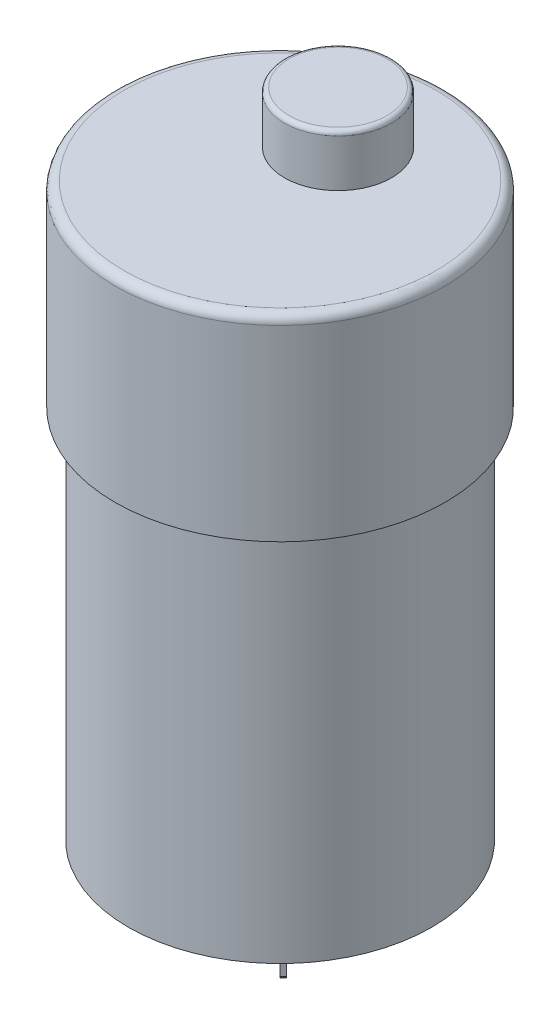
ISO-10303-21;
HEADER;
FILE_DESCRIPTION(('STEP AP214'),'2;1');
FILE_NAME('part.step','',(''),(''),'','','');
FILE_SCHEMA(('AUTOMOTIVE_DESIGN { 1 0 10303 214 1 1 1 1 }'));
ENDSEC;
DATA;
#1=APPLICATION_CONTEXT('core data for automotive mechanical design processes');
#2=APPLICATION_PROTOCOL_DEFINITION('international standard','automotive_design',2000,#1);
#3=PRODUCT_CONTEXT('',#1,'mechanical');
#4=PRODUCT('Part','Part','',(#3));
#5=PRODUCT_RELATED_PRODUCT_CATEGORY('part','',(#4));
#6=PRODUCT_DEFINITION_FORMATION('','',#4);
#7=PRODUCT_DEFINITION_CONTEXT('part definition',#1,'design');
#8=PRODUCT_DEFINITION('design','',#6,#7);
#9=PRODUCT_DEFINITION_SHAPE('','',#8);
#10=(LENGTH_UNIT() NAMED_UNIT(*) SI_UNIT(.MILLI.,.METRE.));
#11=(NAMED_UNIT(*) PLANE_ANGLE_UNIT() SI_UNIT($,.RADIAN.));
#12=(NAMED_UNIT(*) SI_UNIT($,.STERADIAN.) SOLID_ANGLE_UNIT());
#13=UNCERTAINTY_MEASURE_WITH_UNIT(LENGTH_MEASURE(1.E-05),#10,'distance_accuracy_value','');
#14=(GEOMETRIC_REPRESENTATION_CONTEXT(3) GLOBAL_UNCERTAINTY_ASSIGNED_CONTEXT((#13)) GLOBAL_UNIT_ASSIGNED_CONTEXT((#10,
#11,#12)) REPRESENTATION_CONTEXT('',''));
#15=CARTESIAN_POINT('',(0.,0.,0.));
#16=DIRECTION('',(0.,0.,1.));
#17=DIRECTION('',(1.,0.,0.));
#18=AXIS2_PLACEMENT_3D('',#15,#16,#17);
#19=CARTESIAN_POINT('',(0.,-44.5,0.));
#20=DIRECTION('',(0.,-1.,0.));
#21=DIRECTION('',(0.,0.,-1.));
#22=AXIS2_PLACEMENT_3D('',#19,#20,#21);
#23=PLANE('',#22);
#24=CARTESIAN_POINT('',(0.,-44.4999999999709,0.));
#25=DIRECTION('',(0.,1.,0.));
#26=DIRECTION('',(0.,0.,1.));
#27=AXIS2_PLACEMENT_3D('',#24,#25,#26);
#28=CIRCLE('',#27,1.99999999995271);
#29=CARTESIAN_POINT('',(0.,-44.4999999999709,1.99999999995271));
#30=VERTEX_POINT('',#29);
#31=EDGE_CURVE('E18',#30,#30,#28,.T.);
#32=ORIENTED_EDGE('',*,*,#31,.F.);
#33=EDGE_LOOP('',(#32));
#34=FACE_BOUND('',#33,.T.);
#35=ADVANCED_FACE('F15',(#34),#23,.T.);
#36=CARTESIAN_POINT('',(0.,27.8,0.));
#37=DIRECTION('',(0.,1.,0.));
#38=DIRECTION('',(0.,0.,1.));
#39=AXIS2_PLACEMENT_3D('',#36,#37,#38);
#40=PLANE('',#39);
#41=CARTESIAN_POINT('',(0.,27.8,-6.5));
#42=DIRECTION('',(0.,-1.,0.));
#43=DIRECTION('',(1.,0.,0.));
#44=AXIS2_PLACEMENT_3D('',#41,#42,#43);
#45=CIRCLE('',#44,5.5);
#46=CARTESIAN_POINT('',(5.5,27.8,-6.5));
#47=VERTEX_POINT('',#46);
#48=EDGE_CURVE('E229',#47,#47,#45,.T.);
#49=ORIENTED_EDGE('',*,*,#48,.F.);
#50=EDGE_LOOP('',(#49));
#51=FACE_BOUND('',#50,.T.);
#52=ADVANCED_FACE('F233',(#51),#40,.T.);
#53=CARTESIAN_POINT('',(0.,-43.4999999999945,0.));
#54=DIRECTION('',(0.,1.,0.));
#55=DIRECTION('',(0.,0.,1.));
#56=AXIS2_PLACEMENT_3D('',#53,#54,#55);
#57=CONICAL_SURFACE('',#56,2.9999999999859,0.78539816342587);
#58=CARTESIAN_POINT('',(0.,-43.5,0.));
#59=DIRECTION('',(0.,-1.,0.));
#60=DIRECTION('',(0.,0.,-1.));
#61=AXIS2_PLACEMENT_3D('',#58,#59,#60);
#62=CIRCLE('',#61,3.);
#63=CARTESIAN_POINT('',(0.,-43.5,-3.));
#64=VERTEX_POINT('',#63);
#65=EDGE_CURVE('E351',#64,#64,#62,.F.);
#66=ORIENTED_EDGE('',*,*,#65,.F.);
#67=EDGE_LOOP('',(#66));
#68=FACE_BOUND('',#67,.T.);
#69=ORIENTED_EDGE('',*,*,#31,.T.);
#70=EDGE_LOOP('',(#69));
#71=FACE_BOUND('',#70,.T.);
#72=ADVANCED_FACE('F217',(#68,#71),#57,.T.);
#73=CARTESIAN_POINT('',(0.,27.3,-6.5));
#74=DIRECTION('',(0.,1.,0.));
#75=DIRECTION('',(0.,0.,1.));
#76=AXIS2_PLACEMENT_3D('',#73,#74,#75);
#77=TOROIDAL_SURFACE('',#76,5.5,0.5);
#78=CARTESIAN_POINT('',(0.,27.3,-6.5));
#79=DIRECTION('',(0.,1.,0.));
#80=DIRECTION('',(0.,0.,1.));
#81=AXIS2_PLACEMENT_3D('',#78,#79,#80);
#82=CIRCLE('',#81,6.);
#83=CARTESIAN_POINT('',(0.,27.3,-0.5));
#84=VERTEX_POINT('',#83);
#85=EDGE_CURVE('E348',#84,#84,#82,.F.);
#86=ORIENTED_EDGE('',*,*,#85,.F.);
#87=EDGE_LOOP('',(#86));
#88=FACE_BOUND('',#87,.T.);
#89=ORIENTED_EDGE('',*,*,#48,.T.);
#90=EDGE_LOOP('',(#89));
#91=FACE_BOUND('',#90,.T.);
#92=ADVANCED_FACE('F211',(#88,#91),#77,.T.);
#93=CARTESIAN_POINT('',(0.,-41.,0.));
#94=DIRECTION('',(0.,-1.,0.));
#95=DIRECTION('',(0.,0.,-1.));
#96=AXIS2_PLACEMENT_3D('',#93,#94,#95);
#97=CYLINDRICAL_SURFACE('',#96,3.);
#98=CARTESIAN_POINT('',(0.,-42.,0.));
#99=DIRECTION('',(0.,-1.,0.));
#100=DIRECTION('',(0.,0.,-1.));
#101=AXIS2_PLACEMENT_3D('',#98,#99,#100);
#102=CIRCLE('',#101,3.);
#103=CARTESIAN_POINT('',(0.,-42.,-3.));
#104=VERTEX_POINT('',#103);
#105=EDGE_CURVE('E131',#104,#104,#102,.T.);
#106=ORIENTED_EDGE('',*,*,#105,.T.);
#107=EDGE_LOOP('',(#106));
#108=FACE_BOUND('',#107,.T.);
#109=ORIENTED_EDGE('',*,*,#65,.T.);
#110=EDGE_LOOP('',(#109));
#111=FACE_BOUND('',#110,.T.);
#112=ADVANCED_FACE('F207',(#108,#111),#97,.T.);
#113=CARTESIAN_POINT('',(0.,22.,-6.5));
#114=DIRECTION('',(0.,1.,0.));
#115=DIRECTION('',(0.,0.,1.));
#116=AXIS2_PLACEMENT_3D('',#113,#114,#115);
#117=CYLINDRICAL_SURFACE('',#116,6.);
#118=CARTESIAN_POINT('',(0.,22.,-6.5));
#119=DIRECTION('',(0.,1.,0.));
#120=DIRECTION('',(0.,0.,1.));
#121=AXIS2_PLACEMENT_3D('',#118,#119,#120);
#122=CIRCLE('',#121,6.);
#123=CARTESIAN_POINT('',(0.,22.,-0.5));
#124=VERTEX_POINT('',#123);
#125=EDGE_CURVE('E128',#124,#124,#122,.F.);
#126=ORIENTED_EDGE('',*,*,#125,.F.);
#127=EDGE_LOOP('',(#126));
#128=FACE_BOUND('',#127,.T.);
#129=ORIENTED_EDGE('',*,*,#85,.T.);
#130=EDGE_LOOP('',(#129));
#131=FACE_BOUND('',#130,.T.);
#132=ADVANCED_FACE('F204',(#128,#131),#117,.T.);
#133=CARTESIAN_POINT('',(9.41866232540484,-45.75,-9.77221571599806));
#134=DIRECTION('',(0.499999999999998,-0.70710678118655,-0.499999999999998));
#135=DIRECTION('',(0.,0.577350269189623,-0.816496580927728));
#136=AXIS2_PLACEMENT_3D('',#133,#134,#135);
#137=PLANE('',#136);
#138=DIRECTION('',(-0.500000000000015,-0.707106781186526,0.500000000000015));
#139=VECTOR('',#138,1.);
#140=CARTESIAN_POINT('',(9.41866232540483,-45.5,-10.1257691065914));
#141=LINE('',#140,#139);
#142=CARTESIAN_POINT('',(9.41866232540481,-45.5,-10.1257691065914));
#143=VERTEX_POINT('',#142);
#144=CARTESIAN_POINT('',(9.06510893481154,-46.,-9.77221571599808));
#145=VERTEX_POINT('',#144);
#146=EDGE_CURVE('E108',#143,#145,#141,.T.);
#147=ORIENTED_EDGE('',*,*,#146,.F.);
#148=DIRECTION('',(-0.707106781186548,0.,-0.707106781186548));
#149=VECTOR('',#148,1.);
#150=CARTESIAN_POINT('',(9.41866232540481,-45.5,-10.1257691065914));
#151=LINE('',#150,#149);
#152=CARTESIAN_POINT('',(9.77221571599809,-45.5,-9.77221571599809));
#153=VERTEX_POINT('',#152);
#154=EDGE_CURVE('E104',#153,#143,#151,.T.);
#155=ORIENTED_EDGE('',*,*,#154,.F.);
#156=DIRECTION('',(0.500000000000004,0.707106781186542,-0.500000000000004));
#157=VECTOR('',#156,1.);
#158=CARTESIAN_POINT('',(9.41866232540481,-46.,-9.41866232540481));
#159=LINE('',#158,#157);
#160=CARTESIAN_POINT('',(9.41866232540481,-46.,-9.41866232540481));
#161=VERTEX_POINT('',#160);
#162=EDGE_CURVE('E101',#161,#153,#159,.T.);
#163=ORIENTED_EDGE('',*,*,#162,.F.);
#164=DIRECTION('',(0.707106781186548,0.,0.707106781186548));
#165=VECTOR('',#164,1.);
#166=CARTESIAN_POINT('',(9.06510893481154,-46.,-9.77221571599808));
#167=LINE('',#166,#165);
#168=EDGE_CURVE('E346',#145,#161,#167,.T.);
#169=ORIENTED_EDGE('',*,*,#168,.F.);
#170=EDGE_LOOP('',(#147,#155,#163,#169));
#171=FACE_BOUND('',#170,.T.);
#172=ADVANCED_FACE('F106',(#171),#137,.T.);
#173=CARTESIAN_POINT('',(0.,-46.,0.));
#174=DIRECTION('',(0.,-1.,0.));
#175=DIRECTION('',(0.,0.,-1.));
#176=AXIS2_PLACEMENT_3D('',#173,#174,#175);
#177=PLANE('',#176);
#178=DIRECTION('',(0.707106781186547,0.,0.707106781186547));
#179=VECTOR('',#178,1.);
#180=CARTESIAN_POINT('',(8.00444876303172,-46.,-8.71155554421827));
#181=LINE('',#180,#179);
#182=CARTESIAN_POINT('',(8.00444876303172,-46.,-8.71155554421827));
#183=VERTEX_POINT('',#182);
#184=CARTESIAN_POINT('',(8.35800215362499,-46.,-8.358002153625));
#185=VERTEX_POINT('',#184);
#186=EDGE_CURVE('E343',#183,#185,#181,.T.);
#187=ORIENTED_EDGE('',*,*,#186,.F.);
#188=DIRECTION('',(-0.707106781186548,0.,0.707106781186547));
#189=VECTOR('',#188,1.);
#190=CARTESIAN_POINT('',(7.65089537243844,-46.,-8.35800215362499));
#191=LINE('',#190,#189);
#192=EDGE_CURVE('E330',#145,#183,#191,.T.);
#193=ORIENTED_EDGE('',*,*,#192,.F.);
#194=ORIENTED_EDGE('',*,*,#168,.T.);
#195=DIRECTION('',(0.707106781186548,0.,-0.707106781186548));
#196=VECTOR('',#195,1.);
#197=CARTESIAN_POINT('',(9.77221571599809,-46.,-9.77221571599809));
#198=LINE('',#197,#196);
#199=EDGE_CURVE('E127',#185,#161,#198,.T.);
#200=ORIENTED_EDGE('',*,*,#199,.F.);
#201=EDGE_LOOP('',(#187,#193,#194,#200));
#202=FACE_BOUND('',#201,.T.);
#203=ADVANCED_FACE('F197',(#202),#177,.T.);
#204=CARTESIAN_POINT('',(8.00444876303172,-45.75,-8.35800215362499));
#205=DIRECTION('',(-0.499999999999997,-0.70710678118655,0.499999999999999));
#206=DIRECTION('',(0.,-0.577350269189624,-0.816496580927727));
#207=AXIS2_PLACEMENT_3D('',#204,#205,#206);
#208=PLANE('',#207);
#209=DIRECTION('',(0.5,-0.707106781186547,-0.5));
#210=VECTOR('',#209,1.);
#211=CARTESIAN_POINT('',(8.00444876303172,-45.5,-8.00444876303172));
#212=LINE('',#211,#210);
#213=CARTESIAN_POINT('',(8.00444876303172,-45.5,-8.00444876303172));
#214=VERTEX_POINT('',#213);
#215=EDGE_CURVE('E336',#214,#185,#212,.T.);
#216=ORIENTED_EDGE('',*,*,#215,.F.);
#217=DIRECTION('',(0.707106781186548,0.,0.707106781186547));
#218=VECTOR('',#217,1.);
#219=CARTESIAN_POINT('',(8.00444876303172,-45.5,-8.00444876303172));
#220=LINE('',#219,#218);
#221=CARTESIAN_POINT('',(7.65089537243844,-45.5,-8.35800215362499));
#222=VERTEX_POINT('',#221);
#223=EDGE_CURVE('E341',#222,#214,#220,.T.);
#224=ORIENTED_EDGE('',*,*,#223,.F.);
#225=DIRECTION('',(-0.500000000000004,0.707106781186543,0.500000000000002));
#226=VECTOR('',#225,1.);
#227=CARTESIAN_POINT('',(8.00444876303172,-46.,-8.71155554421827));
#228=LINE('',#227,#226);
#229=EDGE_CURVE('E327',#183,#222,#228,.T.);
#230=ORIENTED_EDGE('',*,*,#229,.F.);
#231=ORIENTED_EDGE('',*,*,#186,.T.);
#232=EDGE_LOOP('',(#216,#224,#230,#231));
#233=FACE_BOUND('',#232,.T.);
#234=ADVANCED_FACE('F193',(#233),#208,.T.);
#235=CARTESIAN_POINT('',(8.00444876303172,-41.,-8.00444876303172));
#236=DIRECTION('',(-0.707106781186547,0.,0.707106781186548));
#237=DIRECTION('',(0.707106781186548,0.,0.707106781186547));
#238=AXIS2_PLACEMENT_3D('',#235,#236,#237);
#239=PLANE('',#238);
#240=DIRECTION('',(0.707106781186548,0.,0.707106781186547));
#241=VECTOR('',#240,1.);
#242=CARTESIAN_POINT('',(8.00444876303172,-41.,-8.00444876303172));
#243=LINE('',#242,#241);
#244=CARTESIAN_POINT('',(8.00444876303172,-41.,-8.00444876303172));
#245=VERTEX_POINT('',#244);
#246=CARTESIAN_POINT('',(7.65089537243844,-41.,-8.35800215362499));
#247=VERTEX_POINT('',#246);
#248=EDGE_CURVE('E113',#245,#247,#243,.F.);
#249=ORIENTED_EDGE('',*,*,#248,.T.);
#250=DIRECTION('',(0.,1.,0.));
#251=VECTOR('',#250,1.);
#252=CARTESIAN_POINT('',(7.65089537243844,-41.,-8.35800215362499));
#253=LINE('',#252,#251);
#254=EDGE_CURVE('E324',#222,#247,#253,.T.);
#255=ORIENTED_EDGE('',*,*,#254,.F.);
#256=ORIENTED_EDGE('',*,*,#223,.T.);
#257=DIRECTION('',(0.,1.,0.));
#258=VECTOR('',#257,1.);
#259=CARTESIAN_POINT('',(8.00444876303172,-41.,-8.00444876303172));
#260=LINE('',#259,#258);
#261=EDGE_CURVE('E121',#245,#214,#260,.F.);
#262=ORIENTED_EDGE('',*,*,#261,.F.);
#263=EDGE_LOOP('',(#249,#255,#256,#262));
#264=FACE_BOUND('',#263,.T.);
#265=ADVANCED_FACE('F190',(#264),#239,.T.);
#266=CARTESIAN_POINT('',(9.41866232540481,-41.,-10.1257691065914));
#267=DIRECTION('',(0.707106781186548,0.,-0.707106781186548));
#268=DIRECTION('',(-0.707106781186548,0.,-0.707106781186548));
#269=AXIS2_PLACEMENT_3D('',#266,#267,#268);
#270=PLANE('',#269);
#271=DIRECTION('',(-0.707106781186548,0.,-0.707106781186548));
#272=VECTOR('',#271,1.);
#273=CARTESIAN_POINT('',(9.41866232540481,-41.,-10.1257691065914));
#274=LINE('',#273,#272);
#275=CARTESIAN_POINT('',(9.41866232540482,-41.,-10.1257691065914));
#276=VERTEX_POINT('',#275);
#277=CARTESIAN_POINT('',(9.7722157159981,-41.,-9.7722157159981));
#278=VERTEX_POINT('',#277);
#279=EDGE_CURVE('E112',#276,#278,#274,.F.);
#280=ORIENTED_EDGE('',*,*,#279,.T.);
#281=DIRECTION('',(0.,1.,0.));
#282=VECTOR('',#281,1.);
#283=CARTESIAN_POINT('',(9.77221571599809,-41.,-9.77221571599809));
#284=LINE('',#283,#282);
#285=EDGE_CURVE('E116',#153,#278,#284,.T.);
#286=ORIENTED_EDGE('',*,*,#285,.F.);
#287=ORIENTED_EDGE('',*,*,#154,.T.);
#288=DIRECTION('',(0.,1.,0.));
#289=VECTOR('',#288,1.);
#290=CARTESIAN_POINT('',(9.41866232540483,-41.,-10.1257691065914));
#291=LINE('',#290,#289);
#292=EDGE_CURVE('E322',#276,#143,#291,.F.);
#293=ORIENTED_EDGE('',*,*,#292,.F.);
#294=EDGE_LOOP('',(#280,#286,#287,#293));
#295=FACE_BOUND('',#294,.T.);
#296=ADVANCED_FACE('F117',(#295),#270,.T.);
#297=CARTESIAN_POINT('',(8.53477884892163,-45.,-9.24188563010818));
#298=DIRECTION('',(-0.707106781186547,0.,-0.707106781186548));
#299=DIRECTION('',(-0.707106781186548,0.,0.707106781186547));
#300=AXIS2_PLACEMENT_3D('',#297,#298,#299);
#301=CYLINDRICAL_SURFACE('',#300,0.5);
#302=CARTESIAN_POINT('',(8.53477884892163,-45.,-9.24188563010818));
#303=DIRECTION('',(-0.707106781186547,0.,-0.707106781186548));
#304=DIRECTION('',(-0.707106781186548,0.,0.707106781186547));
#305=AXIS2_PLACEMENT_3D('',#302,#303,#304);
#306=CIRCLE('',#305,0.5);
#307=CARTESIAN_POINT('',(8.18122545832836,-45.,-8.88833223951491));
#308=VERTEX_POINT('',#307);
#309=EDGE_CURVE('E321',#308,#308,#306,.F.);
#310=ORIENTED_EDGE('',*,*,#309,.F.);
#311=EDGE_LOOP('',(#310));
#312=FACE_BOUND('',#311,.T.);
#313=CARTESIAN_POINT('',(8.88833223951491,-45.,-8.88833223951491));
#314=DIRECTION('',(-0.707106781186547,0.,-0.707106781186548));
#315=DIRECTION('',(-0.707106781186548,0.,0.707106781186547));
#316=AXIS2_PLACEMENT_3D('',#313,#314,#315);
#317=CIRCLE('',#316,0.5);
#318=CARTESIAN_POINT('',(8.53477884892163,-45.,-8.53477884892163));
#319=VERTEX_POINT('',#318);
#320=EDGE_CURVE('E334',#319,#319,#317,.T.);
#321=ORIENTED_EDGE('',*,*,#320,.F.);
#322=EDGE_LOOP('',(#321));
#323=FACE_BOUND('',#322,.T.);
#324=ADVANCED_FACE('F183',(#312,#323),#301,.F.);
#325=CARTESIAN_POINT('',(8.358002153625,-45.75,8.00444876303171));
#326=DIRECTION('',(-0.5,-0.707106781186547,-0.5));
#327=DIRECTION('',(0.,0.577350269189626,-0.816496580927726));
#328=AXIS2_PLACEMENT_3D('',#325,#326,#327);
#329=PLANE('',#328);
#330=DIRECTION('',(0.499999999999998,-0.707106781186552,0.499999999999996));
#331=VECTOR('',#330,1.);
#332=CARTESIAN_POINT('',(8.00444876303172,-45.5,8.00444876303172));
#333=LINE('',#332,#331);
#334=CARTESIAN_POINT('',(8.00444876303172,-45.5,8.00444876303172));
#335=VERTEX_POINT('',#334);
#336=CARTESIAN_POINT('',(8.35800215362499,-46.,8.35800215362499));
#337=VERTEX_POINT('',#336);
#338=EDGE_CURVE('E318',#335,#337,#333,.T.);
#339=ORIENTED_EDGE('',*,*,#338,.F.);
#340=DIRECTION('',(-0.707106781186547,0.,0.707106781186548));
#341=VECTOR('',#340,1.);
#342=CARTESIAN_POINT('',(8.00444876303172,-45.5,8.00444876303172));
#343=LINE('',#342,#341);
#344=CARTESIAN_POINT('',(8.35800215362499,-45.5,7.65089537243844));
#345=VERTEX_POINT('',#344);
#346=EDGE_CURVE('E365',#345,#335,#343,.T.);
#347=ORIENTED_EDGE('',*,*,#346,.F.);
#348=DIRECTION('',(-0.500000000000004,0.707106781186543,-0.500000000000002));
#349=VECTOR('',#348,1.);
#350=CARTESIAN_POINT('',(8.71155554421827,-46.,8.00444876303172));
#351=LINE('',#350,#349);
#352=CARTESIAN_POINT('',(8.71155554421827,-46.,8.00444876303172));
#353=VERTEX_POINT('',#352);
#354=EDGE_CURVE('E302',#353,#345,#351,.T.);
#355=ORIENTED_EDGE('',*,*,#354,.F.);
#356=DIRECTION('',(0.707106781186554,0.,-0.707106781186541));
#357=VECTOR('',#356,1.);
#358=CARTESIAN_POINT('',(8.35800215362499,-46.,8.35800215362499));
#359=LINE('',#358,#357);
#360=EDGE_CURVE('E373',#337,#353,#359,.T.);
#361=ORIENTED_EDGE('',*,*,#360,.F.);
#362=EDGE_LOOP('',(#339,#347,#355,#361));
#363=FACE_BOUND('',#362,.T.);
#364=ADVANCED_FACE('F180',(#363),#329,.T.);
#365=CARTESIAN_POINT('',(8.00444876303172,-41.,8.00444876303172));
#366=DIRECTION('',(-0.707106781186548,0.,-0.707106781186547));
#367=DIRECTION('',(-0.707106781186547,0.,0.707106781186548));
#368=AXIS2_PLACEMENT_3D('',#365,#366,#367);
#369=PLANE('',#368);
#370=DIRECTION('',(-0.707106781186547,0.,0.707106781186548));
#371=VECTOR('',#370,1.);
#372=CARTESIAN_POINT('',(8.00444876303172,-41.,8.00444876303172));
#373=LINE('',#372,#371);
#374=CARTESIAN_POINT('',(8.00444876303172,-41.,8.00444876303172));
#375=VERTEX_POINT('',#374);
#376=CARTESIAN_POINT('',(8.35800215362499,-41.,7.65089537243845));
#377=VERTEX_POINT('',#376);
#378=EDGE_CURVE('E33',#375,#377,#373,.F.);
#379=ORIENTED_EDGE('',*,*,#378,.T.);
#380=DIRECTION('',(0.,1.,0.));
#381=VECTOR('',#380,1.);
#382=CARTESIAN_POINT('',(8.35800215362499,-41.,7.65089537243844));
#383=LINE('',#382,#381);
#384=EDGE_CURVE('E300',#345,#377,#383,.T.);
#385=ORIENTED_EDGE('',*,*,#384,.F.);
#386=ORIENTED_EDGE('',*,*,#346,.T.);
#387=DIRECTION('',(0.,1.,0.));
#388=VECTOR('',#387,1.);
#389=CARTESIAN_POINT('',(8.00444876303172,-41.,8.00444876303172));
#390=LINE('',#389,#388);
#391=EDGE_CURVE('E306',#375,#335,#390,.F.);
#392=ORIENTED_EDGE('',*,*,#391,.F.);
#393=EDGE_LOOP('',(#379,#385,#386,#392));
#394=FACE_BOUND('',#393,.T.);
#395=ADVANCED_FACE('F176',(#394),#369,.T.);
#396=CARTESIAN_POINT('',(10.1257691065914,-41.,9.41866232540482));
#397=DIRECTION('',(0.707106781186548,0.,0.707106781186547));
#398=DIRECTION('',(0.707106781186547,0.,-0.707106781186548));
#399=AXIS2_PLACEMENT_3D('',#396,#397,#398);
#400=PLANE('',#399);
#401=DIRECTION('',(0.707106781186547,0.,-0.707106781186548));
#402=VECTOR('',#401,1.);
#403=CARTESIAN_POINT('',(10.1257691065914,-41.,9.41866232540482));
#404=LINE('',#403,#402);
#405=CARTESIAN_POINT('',(10.1257691065914,-41.,9.41866232540482));
#406=VERTEX_POINT('',#405);
#407=CARTESIAN_POINT('',(9.7722157159981,-41.,9.7722157159981));
#408=VERTEX_POINT('',#407);
#409=EDGE_CURVE('E369',#406,#408,#404,.F.);
#410=ORIENTED_EDGE('',*,*,#409,.T.);
#411=DIRECTION('',(0.,1.,0.));
#412=VECTOR('',#411,1.);
#413=CARTESIAN_POINT('',(9.77221571599809,-41.,9.77221571599809));
#414=LINE('',#413,#412);
#415=CARTESIAN_POINT('',(9.7722157159981,-45.5,9.7722157159981));
#416=VERTEX_POINT('',#415);
#417=EDGE_CURVE('E309',#416,#408,#414,.T.);
#418=ORIENTED_EDGE('',*,*,#417,.F.);
#419=DIRECTION('',(-0.70710678118657,0.,0.707106781186525));
#420=VECTOR('',#419,1.);
#421=CARTESIAN_POINT('',(10.1257691065914,-45.5,9.41866232540481));
#422=LINE('',#421,#420);
#423=CARTESIAN_POINT('',(10.1257691065914,-45.5,9.41866232540482));
#424=VERTEX_POINT('',#423);
#425=EDGE_CURVE('E371',#424,#416,#422,.T.);
#426=ORIENTED_EDGE('',*,*,#425,.F.);
#427=DIRECTION('',(0.,1.,0.));
#428=VECTOR('',#427,1.);
#429=CARTESIAN_POINT('',(10.1257691065914,-41.,9.41866232540483));
#430=LINE('',#429,#428);
#431=EDGE_CURVE('E297',#406,#424,#430,.F.);
#432=ORIENTED_EDGE('',*,*,#431,.F.);
#433=EDGE_LOOP('',(#410,#418,#426,#432));
#434=FACE_BOUND('',#433,.T.);
#435=ADVANCED_FACE('F172',(#434),#400,.T.);
#436=CARTESIAN_POINT('',(9.7722157159981,-45.75,9.41866232540481));
#437=DIRECTION('',(0.499999999999993,-0.707106781186558,0.499999999999993));
#438=DIRECTION('',(0.,-0.577350269189615,-0.816496580927734));
#439=AXIS2_PLACEMENT_3D('',#436,#437,#438);
#440=PLANE('',#439);
#441=DIRECTION('',(-0.500000000000022,-0.707106781186516,-0.500000000000022));
#442=VECTOR('',#441,1.);
#443=CARTESIAN_POINT('',(10.1257691065914,-45.5,9.41866232540483));
#444=LINE('',#443,#442);
#445=CARTESIAN_POINT('',(9.77221571599808,-46.,9.06510893481153));
#446=VERTEX_POINT('',#445);
#447=EDGE_CURVE('E294',#424,#446,#444,.T.);
#448=ORIENTED_EDGE('',*,*,#447,.F.);
#449=ORIENTED_EDGE('',*,*,#425,.T.);
#450=DIRECTION('',(0.499999999999996,0.707106781186552,0.499999999999996));
#451=VECTOR('',#450,1.);
#452=CARTESIAN_POINT('',(9.41866232540482,-46.,9.41866232540482));
#453=LINE('',#452,#451);
#454=CARTESIAN_POINT('',(9.41866232540482,-46.,9.41866232540482));
#455=VERTEX_POINT('',#454);
#456=EDGE_CURVE('E312',#455,#416,#453,.T.);
#457=ORIENTED_EDGE('',*,*,#456,.F.);
#458=DIRECTION('',(-0.707106781186516,0.,0.707106781186579));
#459=VECTOR('',#458,1.);
#460=CARTESIAN_POINT('',(9.77221571599808,-46.,9.06510893481153));
#461=LINE('',#460,#459);
#462=EDGE_CURVE('E376',#446,#455,#461,.T.);
#463=ORIENTED_EDGE('',*,*,#462,.F.);
#464=EDGE_LOOP('',(#448,#449,#457,#463));
#465=FACE_BOUND('',#464,.T.);
#466=ADVANCED_FACE('F168',(#465),#440,.T.);
#467=CARTESIAN_POINT('',(0.,-46.,0.));
#468=DIRECTION('',(0.,-1.,0.));
#469=DIRECTION('',(0.,0.,-1.));
#470=AXIS2_PLACEMENT_3D('',#467,#468,#469);
#471=PLANE('',#470);
#472=ORIENTED_EDGE('',*,*,#462,.T.);
#473=DIRECTION('',(0.707106781186548,0.,0.707106781186547));
#474=VECTOR('',#473,1.);
#475=CARTESIAN_POINT('',(9.77221571599809,-46.,9.77221571599809));
#476=LINE('',#475,#474);
#477=EDGE_CURVE('E315',#337,#455,#476,.T.);
#478=ORIENTED_EDGE('',*,*,#477,.F.);
#479=ORIENTED_EDGE('',*,*,#360,.T.);
#480=DIRECTION('',(-0.707106781186548,0.,-0.707106781186547));
#481=VECTOR('',#480,1.);
#482=CARTESIAN_POINT('',(8.35800215362499,-46.,7.65089537243844));
#483=LINE('',#482,#481);
#484=EDGE_CURVE('E290',#446,#353,#483,.T.);
#485=ORIENTED_EDGE('',*,*,#484,.F.);
#486=EDGE_LOOP('',(#472,#478,#479,#485));
#487=FACE_BOUND('',#486,.T.);
#488=ADVANCED_FACE('F164',(#487),#471,.T.);
#489=CARTESIAN_POINT('',(8.88833223951491,-45.,8.8883322395149));
#490=DIRECTION('',(-0.707106781186547,0.,0.707106781186548));
#491=DIRECTION('',(0.707106781186548,0.,0.707106781186547));
#492=AXIS2_PLACEMENT_3D('',#489,#490,#491);
#493=CYLINDRICAL_SURFACE('',#492,0.5);
#494=CARTESIAN_POINT('',(9.24188563010818,-45.,8.53477884892164));
#495=DIRECTION('',(-0.707106781186547,0.,0.707106781186548));
#496=DIRECTION('',(0.707106781186548,0.,0.707106781186547));
#497=AXIS2_PLACEMENT_3D('',#494,#495,#496);
#498=CIRCLE('',#497,0.5);
#499=CARTESIAN_POINT('',(9.59543902070145,-45.,8.88833223951491));
#500=VERTEX_POINT('',#499);
#501=EDGE_CURVE('E293',#500,#500,#498,.T.);
#502=ORIENTED_EDGE('',*,*,#501,.F.);
#503=EDGE_LOOP('',(#502));
#504=FACE_BOUND('',#503,.T.);
#505=CARTESIAN_POINT('',(8.88833223951491,-45.,8.88833223951491));
#506=DIRECTION('',(-0.707106781186547,0.,0.707106781186548));
#507=DIRECTION('',(0.707106781186548,0.,0.707106781186547));
#508=AXIS2_PLACEMENT_3D('',#505,#506,#507);
#509=CIRCLE('',#508,0.5);
#510=CARTESIAN_POINT('',(9.24188563010818,-45.,9.24188563010818));
#511=VERTEX_POINT('',#510);
#512=EDGE_CURVE('E305',#511,#511,#509,.F.);
#513=ORIENTED_EDGE('',*,*,#512,.F.);
#514=EDGE_LOOP('',(#513));
#515=FACE_BOUND('',#514,.T.);
#516=ADVANCED_FACE('F160',(#504,#515),#493,.F.);
#517=CARTESIAN_POINT('',(0.,-42.,0.));
#518=DIRECTION('',(0.,1.,0.));
#519=DIRECTION('',(0.,0.,1.));
#520=AXIS2_PLACEMENT_3D('',#517,#518,#519);
#521=PLANE('',#520);
#522=ORIENTED_EDGE('',*,*,#105,.F.);
#523=EDGE_LOOP('',(#522));
#524=FACE_BOUND('',#523,.T.);
#525=CARTESIAN_POINT('',(0.,-42.,0.));
#526=DIRECTION('',(0.,-1.,0.));
#527=DIRECTION('',(0.,0.,-1.));
#528=AXIS2_PLACEMENT_3D('',#525,#526,#527);
#529=CIRCLE('',#528,5.);
#530=CARTESIAN_POINT('',(0.,-42.,-5.));
#531=VERTEX_POINT('',#530);
#532=EDGE_CURVE('E398',#531,#531,#529,.F.);
#533=ORIENTED_EDGE('',*,*,#532,.F.);
#534=EDGE_LOOP('',(#533));
#535=FACE_BOUND('',#534,.T.);
#536=ADVANCED_FACE('F155',(#524,#535),#521,.F.);
#537=CARTESIAN_POINT('',(0.,22.,0.));
#538=DIRECTION('',(0.,1.,0.));
#539=DIRECTION('',(0.,0.,1.));
#540=AXIS2_PLACEMENT_3D('',#537,#538,#539);
#541=PLANE('',#540);
#542=ORIENTED_EDGE('',*,*,#125,.T.);
#543=EDGE_LOOP('',(#542));
#544=FACE_BOUND('',#543,.T.);
#545=CARTESIAN_POINT('',(0.,22.,0.));
#546=DIRECTION('',(0.,-1.,0.));
#547=DIRECTION('',(0.,0.,-1.));
#548=AXIS2_PLACEMENT_3D('',#545,#546,#547);
#549=CIRCLE('',#548,17.5);
#550=CARTESIAN_POINT('',(0.,22.,-17.5));
#551=VERTEX_POINT('',#550);
#552=EDGE_CURVE('E139',#551,#551,#549,.T.);
#553=ORIENTED_EDGE('',*,*,#552,.F.);
#554=EDGE_LOOP('',(#553));
#555=FACE_BOUND('',#554,.T.);
#556=ADVANCED_FACE('F145',(#544,#555),#541,.T.);
#557=CARTESIAN_POINT('',(9.77221571599809,-41.,-9.77221571599809));
#558=DIRECTION('',(0.707106781186548,0.,0.707106781186548));
#559=DIRECTION('',(0.707106781186548,0.,-0.707106781186548));
#560=AXIS2_PLACEMENT_3D('',#557,#558,#559);
#561=PLANE('',#560);
#562=ORIENTED_EDGE('',*,*,#320,.T.);
#563=EDGE_LOOP('',(#562));
#564=FACE_BOUND('',#563,.T.);
#565=ORIENTED_EDGE('',*,*,#215,.T.);
#566=ORIENTED_EDGE('',*,*,#199,.T.);
#567=ORIENTED_EDGE('',*,*,#162,.T.);
#568=ORIENTED_EDGE('',*,*,#285,.T.);
#569=DIRECTION('',(0.707106781186547,0.,-0.707106781186547));
#570=VECTOR('',#569,1.);
#571=CARTESIAN_POINT('',(8.00444876303172,-41.,-8.00444876303172));
#572=LINE('',#571,#570);
#573=EDGE_CURVE('E288',#245,#278,#572,.T.);
#574=ORIENTED_EDGE('',*,*,#573,.F.);
#575=ORIENTED_EDGE('',*,*,#261,.T.);
#576=EDGE_LOOP('',(#565,#566,#567,#568,#574,#575));
#577=FACE_BOUND('',#576,.T.);
#578=ADVANCED_FACE('F125',(#564,#577),#561,.T.);
#579=CARTESIAN_POINT('',(7.65089537243844,-41.,-8.35800215362499));
#580=DIRECTION('',(-0.707106781186547,0.,-0.707106781186548));
#581=DIRECTION('',(-0.707106781186548,0.,0.707106781186547));
#582=AXIS2_PLACEMENT_3D('',#579,#580,#581);
#583=PLANE('',#582);
#584=ORIENTED_EDGE('',*,*,#309,.T.);
#585=EDGE_LOOP('',(#584));
#586=FACE_BOUND('',#585,.T.);
#587=DIRECTION('',(-0.70710678118654,0.,0.707106781186556));
#588=VECTOR('',#587,1.);
#589=CARTESIAN_POINT('',(9.41866232540481,-41.,-10.1257691065914));
#590=LINE('',#589,#588);
#591=EDGE_CURVE('E437',#276,#247,#590,.T.);
#592=ORIENTED_EDGE('',*,*,#591,.F.);
#593=ORIENTED_EDGE('',*,*,#292,.T.);
#594=ORIENTED_EDGE('',*,*,#146,.T.);
#595=ORIENTED_EDGE('',*,*,#192,.T.);
#596=ORIENTED_EDGE('',*,*,#229,.T.);
#597=ORIENTED_EDGE('',*,*,#254,.T.);
#598=EDGE_LOOP('',(#592,#593,#594,#595,#596,#597));
#599=FACE_BOUND('',#598,.T.);
#600=ADVANCED_FACE('F444',(#586,#599),#583,.T.);
#601=CARTESIAN_POINT('',(9.77221571599809,-41.,9.77221571599809));
#602=DIRECTION('',(-0.707106781186547,0.,0.707106781186548));
#603=DIRECTION('',(0.707106781186548,0.,0.707106781186547));
#604=AXIS2_PLACEMENT_3D('',#601,#602,#603);
#605=PLANE('',#604);
#606=ORIENTED_EDGE('',*,*,#512,.T.);
#607=EDGE_LOOP('',(#606));
#608=FACE_BOUND('',#607,.T.);
#609=DIRECTION('',(0.707106781186547,0.,0.707106781186547));
#610=VECTOR('',#609,1.);
#611=CARTESIAN_POINT('',(8.00444876303172,-41.,8.00444876303172));
#612=LINE('',#611,#610);
#613=EDGE_CURVE('E435',#375,#408,#612,.T.);
#614=ORIENTED_EDGE('',*,*,#613,.F.);
#615=ORIENTED_EDGE('',*,*,#391,.T.);
#616=ORIENTED_EDGE('',*,*,#338,.T.);
#617=ORIENTED_EDGE('',*,*,#477,.T.);
#618=ORIENTED_EDGE('',*,*,#456,.T.);
#619=ORIENTED_EDGE('',*,*,#417,.T.);
#620=EDGE_LOOP('',(#614,#615,#616,#617,#618,#619));
#621=FACE_BOUND('',#620,.T.);
#622=ADVANCED_FACE('F446',(#608,#621),#605,.T.);
#623=CARTESIAN_POINT('',(8.35800215362499,-41.,7.65089537243844));
#624=DIRECTION('',(0.707106781186547,0.,-0.707106781186548));
#625=DIRECTION('',(-0.707106781186548,0.,-0.707106781186547));
#626=AXIS2_PLACEMENT_3D('',#623,#624,#625);
#627=PLANE('',#626);
#628=ORIENTED_EDGE('',*,*,#501,.T.);
#629=EDGE_LOOP('',(#628));
#630=FACE_BOUND('',#629,.T.);
#631=ORIENTED_EDGE('',*,*,#447,.T.);
#632=ORIENTED_EDGE('',*,*,#484,.T.);
#633=ORIENTED_EDGE('',*,*,#354,.T.);
#634=ORIENTED_EDGE('',*,*,#384,.T.);
#635=DIRECTION('',(-0.707106781186555,0.,-0.70710678118654));
#636=VECTOR('',#635,1.);
#637=CARTESIAN_POINT('',(10.1257691065914,-41.,9.41866232540482));
#638=LINE('',#637,#636);
#639=EDGE_CURVE('E405',#406,#377,#638,.T.);
#640=ORIENTED_EDGE('',*,*,#639,.F.);
#641=ORIENTED_EDGE('',*,*,#431,.T.);
#642=EDGE_LOOP('',(#631,#632,#633,#634,#640,#641));
#643=FACE_BOUND('',#642,.T.);
#644=ADVANCED_FACE('F452',(#630,#643),#627,.T.);
#645=CARTESIAN_POINT('',(0.,-42.,0.));
#646=DIRECTION('',(0.,-1.,0.));
#647=DIRECTION('',(0.,0.,-1.));
#648=AXIS2_PLACEMENT_3D('',#645,#646,#647);
#649=CYLINDRICAL_SURFACE('',#648,5.);
#650=CARTESIAN_POINT('',(0.,-41.,0.));
#651=DIRECTION('',(0.,-1.,0.));
#652=DIRECTION('',(0.,0.,-1.));
#653=AXIS2_PLACEMENT_3D('',#650,#651,#652);
#654=CIRCLE('',#653,5.);
#655=CARTESIAN_POINT('',(0.,-41.,-5.));
#656=VERTEX_POINT('',#655);
#657=EDGE_CURVE('E401',#656,#656,#654,.F.);
#658=ORIENTED_EDGE('',*,*,#657,.F.);
#659=EDGE_LOOP('',(#658));
#660=FACE_BOUND('',#659,.T.);
#661=ORIENTED_EDGE('',*,*,#532,.T.);
#662=EDGE_LOOP('',(#661));
#663=FACE_BOUND('',#662,.T.);
#664=ADVANCED_FACE('F282',(#660,#663),#649,.T.);
#665=CARTESIAN_POINT('',(0.,21.,0.));
#666=DIRECTION('',(0.,1.,0.));
#667=DIRECTION('',(0.,0.,1.));
#668=AXIS2_PLACEMENT_3D('',#665,#666,#667);
#669=TOROIDAL_SURFACE('',#668,17.5,1.);
#670=CARTESIAN_POINT('',(0.,21.,0.));
#671=DIRECTION('',(0.,1.,0.));
#672=DIRECTION('',(0.,0.,1.));
#673=AXIS2_PLACEMENT_3D('',#670,#671,#672);
#674=CIRCLE('',#673,18.5);
#675=CARTESIAN_POINT('',(0.,21.,18.5));
#676=VERTEX_POINT('',#675);
#677=EDGE_CURVE('E404',#676,#676,#674,.F.);
#678=ORIENTED_EDGE('',*,*,#677,.F.);
#679=EDGE_LOOP('',(#678));
#680=FACE_BOUND('',#679,.T.);
#681=ORIENTED_EDGE('',*,*,#552,.T.);
#682=EDGE_LOOP('',(#681));
#683=FACE_BOUND('',#682,.T.);
#684=ADVANCED_FACE('F276',(#680,#683),#669,.T.);
#685=CARTESIAN_POINT('',(0.,-41.,0.));
#686=DIRECTION('',(0.,-1.,0.));
#687=DIRECTION('',(0.,0.,-1.));
#688=AXIS2_PLACEMENT_3D('',#685,#686,#687);
#689=PLANE('',#688);
#690=ORIENTED_EDGE('',*,*,#657,.T.);
#691=EDGE_LOOP('',(#690));
#692=FACE_BOUND('',#691,.T.);
#693=ORIENTED_EDGE('',*,*,#639,.T.);
#694=ORIENTED_EDGE('',*,*,#378,.F.);
#695=ORIENTED_EDGE('',*,*,#613,.T.);
#696=ORIENTED_EDGE('',*,*,#409,.F.);
#697=EDGE_LOOP('',(#693,#694,#695,#696));
#698=FACE_BOUND('',#697,.T.);
#699=ORIENTED_EDGE('',*,*,#591,.T.);
#700=ORIENTED_EDGE('',*,*,#248,.F.);
#701=ORIENTED_EDGE('',*,*,#573,.T.);
#702=ORIENTED_EDGE('',*,*,#279,.F.);
#703=EDGE_LOOP('',(#699,#700,#701,#702));
#704=FACE_BOUND('',#703,.T.);
#705=CARTESIAN_POINT('',(0.,-41.,0.));
#706=DIRECTION('',(0.,-1.,0.));
#707=DIRECTION('',(0.,0.,-1.));
#708=AXIS2_PLACEMENT_3D('',#705,#706,#707);
#709=CIRCLE('',#708,16.5);
#710=CARTESIAN_POINT('',(0.,-41.,-16.5));
#711=VERTEX_POINT('',#710);
#712=EDGE_CURVE('E406',#711,#711,#709,.T.);
#713=ORIENTED_EDGE('',*,*,#712,.T.);
#714=EDGE_LOOP('',(#713));
#715=FACE_BOUND('',#714,.T.);
#716=ADVANCED_FACE('F272',(#692,#698,#704,#715),#689,.T.);
#717=CARTESIAN_POINT('',(0.,0.,0.));
#718=DIRECTION('',(0.,1.,0.));
#719=DIRECTION('',(0.,0.,1.));
#720=AXIS2_PLACEMENT_3D('',#717,#718,#719);
#721=CYLINDRICAL_SURFACE('',#720,18.5);
#722=CARTESIAN_POINT('',(0.,0.,0.));
#723=DIRECTION('',(0.,1.,0.));
#724=DIRECTION('',(0.,0.,1.));
#725=AXIS2_PLACEMENT_3D('',#722,#723,#724);
#726=CIRCLE('',#725,18.5);
#727=CARTESIAN_POINT('',(0.,0.,18.5));
#728=VERTEX_POINT('',#727);
#729=EDGE_CURVE('E409',#728,#728,#726,.T.);
#730=ORIENTED_EDGE('',*,*,#729,.T.);
#731=EDGE_LOOP('',(#730));
#732=FACE_BOUND('',#731,.T.);
#733=ORIENTED_EDGE('',*,*,#677,.T.);
#734=EDGE_LOOP('',(#733));
#735=FACE_BOUND('',#734,.T.);
#736=ADVANCED_FACE('F268',(#732,#735),#721,.T.);
#737=CARTESIAN_POINT('',(0.,-42.,0.));
#738=DIRECTION('',(0.,-1.,0.));
#739=DIRECTION('',(0.,0.,-1.));
#740=AXIS2_PLACEMENT_3D('',#737,#738,#739);
#741=CYLINDRICAL_SURFACE('',#740,16.5);
#742=ORIENTED_EDGE('',*,*,#712,.F.);
#743=EDGE_LOOP('',(#742));
#744=FACE_BOUND('',#743,.T.);
#745=CARTESIAN_POINT('',(0.,-42.,0.));
#746=DIRECTION('',(0.,-1.,0.));
#747=DIRECTION('',(0.,0.,-1.));
#748=AXIS2_PLACEMENT_3D('',#745,#746,#747);
#749=CIRCLE('',#748,16.5);
#750=CARTESIAN_POINT('',(0.,-42.,-16.5));
#751=VERTEX_POINT('',#750);
#752=EDGE_CURVE('E412',#751,#751,#749,.T.);
#753=ORIENTED_EDGE('',*,*,#752,.T.);
#754=EDGE_LOOP('',(#753));
#755=FACE_BOUND('',#754,.T.);
#756=ADVANCED_FACE('F264',(#744,#755),#741,.F.);
#757=CARTESIAN_POINT('',(0.,0.,0.));
#758=DIRECTION('',(0.,1.,0.));
#759=DIRECTION('',(0.,0.,1.));
#760=AXIS2_PLACEMENT_3D('',#757,#758,#759);
#761=PLANE('',#760);
#762=CARTESIAN_POINT('',(0.,0.,0.));
#763=DIRECTION('',(0.,1.,0.));
#764=DIRECTION('',(0.,0.,1.));
#765=AXIS2_PLACEMENT_3D('',#762,#763,#764);
#766=CIRCLE('',#765,17.);
#767=CARTESIAN_POINT('',(0.,0.,17.));
#768=VERTEX_POINT('',#767);
#769=EDGE_CURVE('E24',#768,#768,#766,.F.);
#770=ORIENTED_EDGE('',*,*,#769,.F.);
#771=EDGE_LOOP('',(#770));
#772=FACE_BOUND('',#771,.T.);
#773=ORIENTED_EDGE('',*,*,#729,.F.);
#774=EDGE_LOOP('',(#773));
#775=FACE_BOUND('',#774,.T.);
#776=ADVANCED_FACE('F257',(#772,#775),#761,.F.);
#777=CARTESIAN_POINT('',(0.,-42.,0.));
#778=DIRECTION('',(0.,1.,0.));
#779=DIRECTION('',(0.,0.,1.));
#780=AXIS2_PLACEMENT_3D('',#777,#778,#779);
#781=PLANE('',#780);
#782=ORIENTED_EDGE('',*,*,#752,.F.);
#783=EDGE_LOOP('',(#782));
#784=FACE_BOUND('',#783,.T.);
#785=CARTESIAN_POINT('',(0.,-42.,0.));
#786=DIRECTION('',(0.,1.,0.));
#787=DIRECTION('',(0.,0.,1.));
#788=AXIS2_PLACEMENT_3D('',#785,#786,#787);
#789=CIRCLE('',#788,17.);
#790=CARTESIAN_POINT('',(0.,-42.,17.));
#791=VERTEX_POINT('',#790);
#792=EDGE_CURVE('E10',#791,#791,#789,.T.);
#793=ORIENTED_EDGE('',*,*,#792,.F.);
#794=EDGE_LOOP('',(#793));
#795=FACE_BOUND('',#794,.T.);
#796=ADVANCED_FACE('F251',(#784,#795),#781,.F.);
#797=CARTESIAN_POINT('',(0.,0.,0.));
#798=DIRECTION('',(0.,1.,0.));
#799=DIRECTION('',(0.,0.,1.));
#800=AXIS2_PLACEMENT_3D('',#797,#798,#799);
#801=CYLINDRICAL_SURFACE('',#800,17.);
#802=ORIENTED_EDGE('',*,*,#792,.T.);
#803=EDGE_LOOP('',(#802));
#804=FACE_BOUND('',#803,.T.);
#805=ORIENTED_EDGE('',*,*,#769,.T.);
#806=EDGE_LOOP('',(#805));
#807=FACE_BOUND('',#806,.T.);
#808=ADVANCED_FACE('F249',(#804,#807),#801,.T.);
#809=CLOSED_SHELL('',(#35,#52,#72,#92,#112,#132,#172,#203,#234,#265,#296,#324,#364,#395,#435,
#466,#488,#516,#536,#556,#578,#600,#622,#644,#664,#684,#716,#736,#756,#776,#796,#808));
#810=MANIFOLD_SOLID_BREP('B1',#809);
#811=ADVANCED_BREP_SHAPE_REPRESENTATION('',(#18,#810),#14);
#812=SHAPE_DEFINITION_REPRESENTATION(#9,#811);
ENDSEC;
END-ISO-10303-21;
